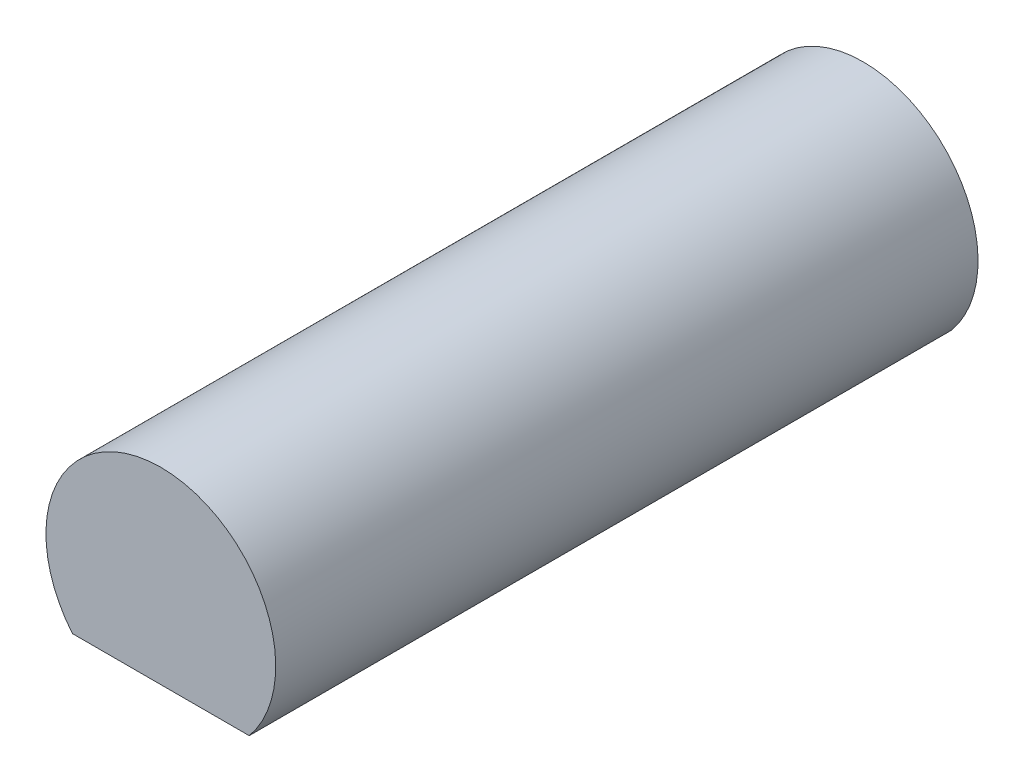
ISO-10303-21;
HEADER;
FILE_DESCRIPTION(('STEP AP214'),'2;1');
FILE_NAME('part.step','',(''),(''),'','','');
FILE_SCHEMA(('AUTOMOTIVE_DESIGN { 1 0 10303 214 1 1 1 1 }'));
ENDSEC;
DATA;
#1=APPLICATION_CONTEXT('core data for automotive mechanical design processes');
#2=APPLICATION_PROTOCOL_DEFINITION('international standard','automotive_design',2000,#1);
#3=PRODUCT_CONTEXT('',#1,'mechanical');
#4=PRODUCT('Part','Part','',(#3));
#5=PRODUCT_RELATED_PRODUCT_CATEGORY('part','',(#4));
#6=PRODUCT_DEFINITION_FORMATION('','',#4);
#7=PRODUCT_DEFINITION_CONTEXT('part definition',#1,'design');
#8=PRODUCT_DEFINITION('design','',#6,#7);
#9=PRODUCT_DEFINITION_SHAPE('','',#8);
#10=(LENGTH_UNIT() NAMED_UNIT(*) SI_UNIT(.MILLI.,.METRE.));
#11=(NAMED_UNIT(*) PLANE_ANGLE_UNIT() SI_UNIT($,.RADIAN.));
#12=(NAMED_UNIT(*) SI_UNIT($,.STERADIAN.) SOLID_ANGLE_UNIT());
#13=UNCERTAINTY_MEASURE_WITH_UNIT(LENGTH_MEASURE(1.E-05),#10,'distance_accuracy_value','');
#14=(GEOMETRIC_REPRESENTATION_CONTEXT(3) GLOBAL_UNCERTAINTY_ASSIGNED_CONTEXT((#13)) GLOBAL_UNIT_ASSIGNED_CONTEXT((#10,
#11,#12)) REPRESENTATION_CONTEXT('',''));
#15=CARTESIAN_POINT('',(0.,0.,0.));
#16=DIRECTION('',(0.,0.,1.));
#17=DIRECTION('',(1.,0.,0.));
#18=AXIS2_PLACEMENT_3D('',#15,#16,#17);
#19=CARTESIAN_POINT('',(0.,-0.955,9.14));
#20=DIRECTION('',(0.,1.,0.));
#21=DIRECTION('',(0.,0.,1.));
#22=AXIS2_PLACEMENT_3D('',#19,#20,#21);
#23=PLANE('',#22);
#24=DIRECTION('',(1.,0.,0.));
#25=VECTOR('',#24,1.);
#26=CARTESIAN_POINT('',(0.,-0.955,0.));
#27=LINE('',#26,#25);
#28=CARTESIAN_POINT('',(-1.15021737076085,-0.954999999999999,0.));
#29=VERTEX_POINT('',#28);
#30=CARTESIAN_POINT('',(1.15021737076085,-0.955,0.));
#31=VERTEX_POINT('',#30);
#32=EDGE_CURVE('E56',#29,#31,#27,.T.);
#33=ORIENTED_EDGE('',*,*,#32,.T.);
#34=DIRECTION('',(0.,0.,-1.));
#35=VECTOR('',#34,1.);
#36=CARTESIAN_POINT('',(1.15021737076085,-0.955,9.14));
#37=LINE('',#36,#35);
#38=CARTESIAN_POINT('',(1.15021737076085,-0.955,9.14));
#39=VERTEX_POINT('',#38);
#40=EDGE_CURVE('E11',#39,#31,#37,.T.);
#41=ORIENTED_EDGE('',*,*,#40,.F.);
#42=DIRECTION('',(1.,0.,0.));
#43=VECTOR('',#42,1.);
#44=CARTESIAN_POINT('',(0.,-0.955,9.14));
#45=LINE('',#44,#43);
#46=CARTESIAN_POINT('',(-1.15021737076085,-0.954999999999999,9.14));
#47=VERTEX_POINT('',#46);
#48=EDGE_CURVE('E66',#47,#39,#45,.T.);
#49=ORIENTED_EDGE('',*,*,#48,.F.);
#50=DIRECTION('',(0.,0.,-1.));
#51=VECTOR('',#50,1.);
#52=CARTESIAN_POINT('',(-1.15021737076085,-0.954999999999999,9.14));
#53=LINE('',#52,#51);
#54=EDGE_CURVE('E40',#47,#29,#53,.T.);
#55=ORIENTED_EDGE('',*,*,#54,.T.);
#56=EDGE_LOOP('',(#33,#41,#49,#55));
#57=FACE_BOUND('',#56,.T.);
#58=ADVANCED_FACE('F32',(#57),#23,.F.);
#59=CARTESIAN_POINT('',(0.,0.,9.14));
#60=DIRECTION('',(0.,0.,-1.));
#61=DIRECTION('',(-1.,0.,0.));
#62=AXIS2_PLACEMENT_3D('',#59,#60,#61);
#63=CYLINDRICAL_SURFACE('',#62,1.495);
#64=CARTESIAN_POINT('',(0.,0.,0.));
#65=DIRECTION('',(0.,0.,1.));
#66=DIRECTION('',(1.,0.,0.));
#67=AXIS2_PLACEMENT_3D('',#64,#65,#66);
#68=CIRCLE('',#67,1.495);
#69=EDGE_CURVE('E61',#31,#29,#68,.T.);
#70=ORIENTED_EDGE('',*,*,#69,.T.);
#71=ORIENTED_EDGE('',*,*,#54,.F.);
#72=CARTESIAN_POINT('',(0.,0.,9.14));
#73=DIRECTION('',(0.,0.,1.));
#74=DIRECTION('',(1.,0.,0.));
#75=AXIS2_PLACEMENT_3D('',#72,#73,#74);
#76=CIRCLE('',#75,1.495);
#77=EDGE_CURVE('E47',#39,#47,#76,.T.);
#78=ORIENTED_EDGE('',*,*,#77,.F.);
#79=ORIENTED_EDGE('',*,*,#40,.T.);
#80=EDGE_LOOP('',(#70,#71,#78,#79));
#81=FACE_BOUND('',#80,.T.);
#82=ADVANCED_FACE('F64',(#81),#63,.T.);
#83=CARTESIAN_POINT('',(0.,0.,9.14));
#84=DIRECTION('',(0.,0.,1.));
#85=DIRECTION('',(1.,0.,0.));
#86=AXIS2_PLACEMENT_3D('',#83,#84,#85);
#87=PLANE('',#86);
#88=ORIENTED_EDGE('',*,*,#48,.T.);
#89=ORIENTED_EDGE('',*,*,#77,.T.);
#90=EDGE_LOOP('',(#88,#89));
#91=FACE_BOUND('',#90,.T.);
#92=ADVANCED_FACE('F70',(#91),#87,.T.);
#93=CARTESIAN_POINT('',(0.,0.,0.));
#94=DIRECTION('',(0.,0.,1.));
#95=DIRECTION('',(1.,0.,0.));
#96=AXIS2_PLACEMENT_3D('',#93,#94,#95);
#97=PLANE('',#96);
#98=ORIENTED_EDGE('',*,*,#32,.F.);
#99=ORIENTED_EDGE('',*,*,#69,.F.);
#100=EDGE_LOOP('',(#98,#99));
#101=FACE_BOUND('',#100,.T.);
#102=ADVANCED_FACE('F60',(#101),#97,.F.);
#103=CLOSED_SHELL('',(#58,#82,#92,#102));
#104=MANIFOLD_SOLID_BREP('B2',#103);
#105=ADVANCED_BREP_SHAPE_REPRESENTATION('',(#18,#104),#14);
#106=SHAPE_DEFINITION_REPRESENTATION(#9,#105);
ENDSEC;
END-ISO-10303-21;
